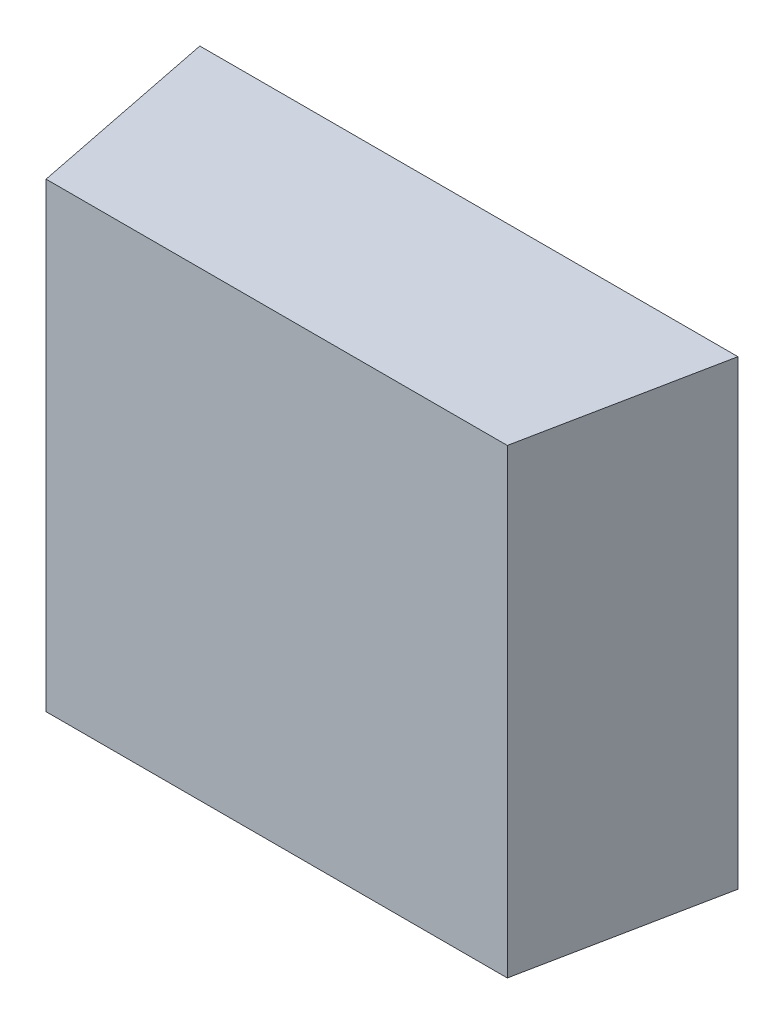
ISO-10303-21;
HEADER;
FILE_DESCRIPTION(('STEP AP214'),'2;1');
FILE_NAME('part.step','',(''),(''),'','','');
FILE_SCHEMA(('AUTOMOTIVE_DESIGN { 1 0 10303 214 1 1 1 1 }'));
ENDSEC;
DATA;
#1=APPLICATION_CONTEXT('core data for automotive mechanical design processes');
#2=APPLICATION_PROTOCOL_DEFINITION('international standard','automotive_design',2000,#1);
#3=PRODUCT_CONTEXT('',#1,'mechanical');
#4=PRODUCT('Part','Part','',(#3));
#5=PRODUCT_RELATED_PRODUCT_CATEGORY('part','',(#4));
#6=PRODUCT_DEFINITION_FORMATION('','',#4);
#7=PRODUCT_DEFINITION_CONTEXT('part definition',#1,'design');
#8=PRODUCT_DEFINITION('design','',#6,#7);
#9=PRODUCT_DEFINITION_SHAPE('','',#8);
#10=(LENGTH_UNIT() NAMED_UNIT(*) SI_UNIT(.MILLI.,.METRE.));
#11=(NAMED_UNIT(*) PLANE_ANGLE_UNIT() SI_UNIT($,.RADIAN.));
#12=(NAMED_UNIT(*) SI_UNIT($,.STERADIAN.) SOLID_ANGLE_UNIT());
#13=UNCERTAINTY_MEASURE_WITH_UNIT(LENGTH_MEASURE(1.E-05),#10,'distance_accuracy_value','');
#14=(GEOMETRIC_REPRESENTATION_CONTEXT(3) GLOBAL_UNCERTAINTY_ASSIGNED_CONTEXT((#13)) GLOBAL_UNIT_ASSIGNED_CONTEXT((#10,
#11,#12)) REPRESENTATION_CONTEXT('',''));
#15=CARTESIAN_POINT('',(0.,0.,0.));
#16=DIRECTION('',(0.,0.,1.));
#17=DIRECTION('',(1.,0.,0.));
#18=AXIS2_PLACEMENT_3D('',#15,#16,#17);
#19=CARTESIAN_POINT('',(-0.232885678621241,-0.927979057558617,0.0911708661417334));
#20=DIRECTION('',(0.,0.,-1.));
#21=DIRECTION('',(-1.,0.,0.));
#22=AXIS2_PLACEMENT_3D('',#19,#20,#21);
#23=PLANE('',#22);
#24=DIRECTION('',(0.,1.,0.));
#25=VECTOR('',#24,1.);
#26=CARTESIAN_POINT('',(-0.230925048699981,-0.927979057558617,0.0911708661417335));
#27=LINE('',#26,#25);
#28=CARTESIAN_POINT('',(-0.230925048699981,-0.929939687479877,0.0911708661417334));
#29=VERTEX_POINT('',#28);
#30=CARTESIAN_POINT('',(-0.230925048699981,-0.969152285905073,0.0911708661417334));
#31=VERTEX_POINT('',#30);
#32=EDGE_CURVE('E20',#29,#31,#27,.F.);
#33=ORIENTED_EDGE('',*,*,#32,.T.);
#34=DIRECTION('',(1.,0.,0.));
#35=VECTOR('',#34,1.);
#36=CARTESIAN_POINT('',(-0.236480166810218,-0.969152285905073,0.0911708661417334));
#37=LINE('',#36,#35);
#38=CARTESIAN_POINT('',(-0.191712450274785,-0.969152285905073,0.0911708661417334));
#39=VERTEX_POINT('',#38);
#40=EDGE_CURVE('E55',#39,#31,#37,.F.);
#41=ORIENTED_EDGE('',*,*,#40,.F.);
#42=DIRECTION('',(0.,1.,0.));
#43=VECTOR('',#42,1.);
#44=CARTESIAN_POINT('',(-0.191712450274784,-0.927979057558617,0.0911708661417335));
#45=LINE('',#44,#43);
#46=CARTESIAN_POINT('',(-0.191712450274785,-0.929939687479877,0.0911708661417335));
#47=VERTEX_POINT('',#46);
#48=EDGE_CURVE('E76',#39,#47,#45,.T.);
#49=ORIENTED_EDGE('',*,*,#48,.T.);
#50=DIRECTION('',(1.,0.,0.));
#51=VECTOR('',#50,1.);
#52=CARTESIAN_POINT('',(-0.236480166810218,-0.929939687479877,0.0911708661417334));
#53=LINE('',#52,#51);
#54=EDGE_CURVE('E58',#47,#29,#53,.F.);
#55=ORIENTED_EDGE('',*,*,#54,.T.);
#56=EDGE_LOOP('',(#33,#41,#49,#55));
#57=FACE_BOUND('',#56,.T.);
#58=ADVANCED_FACE('F17',(#57),#23,.F.);
#59=CARTESIAN_POINT('',(-0.234356151062186,-0.927979057558617,0.0740153543307098));
#60=DIRECTION('',(0.980580675690921,0.,-0.196116135138182));
#61=DIRECTION('',(-0.196116135138182,0.,-0.980580675690921));
#62=AXIS2_PLACEMENT_3D('',#59,#60,#61);
#63=PLANE('',#62);
#64=DIRECTION('',(0.,1.,0.));
#65=VECTOR('',#64,1.);
#66=CARTESIAN_POINT('',(-0.234192765235415,-0.927979057558617,0.0748322834645681));
#67=LINE('',#66,#65);
#68=CARTESIAN_POINT('',(-0.234192765235415,-0.929939687479877,0.0748322834645681));
#69=VERTEX_POINT('',#68);
#70=CARTESIAN_POINT('',(-0.234192765235415,-0.969152285905073,0.0748322834645681));
#71=VERTEX_POINT('',#70);
#72=EDGE_CURVE('E73',#69,#71,#67,.F.);
#73=ORIENTED_EDGE('',*,*,#72,.T.);
#74=DIRECTION('',(-0.196116135138237,0.,-0.98058067569091));
#75=VECTOR('',#74,1.);
#76=CARTESIAN_POINT('',(-0.230925048699981,-0.969152285905073,0.0911708661417334));
#77=LINE('',#76,#75);
#78=EDGE_CURVE('E63',#31,#71,#77,.T.);
#79=ORIENTED_EDGE('',*,*,#78,.F.);
#80=ORIENTED_EDGE('',*,*,#32,.F.);
#81=DIRECTION('',(-0.196116135138237,0.,-0.98058067569091));
#82=VECTOR('',#81,1.);
#83=CARTESIAN_POINT('',(-0.230925048699981,-0.929939687479877,0.0911708661417334));
#84=LINE('',#83,#82);
#85=EDGE_CURVE('E80',#29,#69,#84,.T.);
#86=ORIENTED_EDGE('',*,*,#85,.T.);
#87=EDGE_LOOP('',(#73,#79,#80,#86));
#88=FACE_BOUND('',#87,.T.);
#89=ADVANCED_FACE('F72',(#88),#63,.F.);
#90=CARTESIAN_POINT('',(-0.236480166810218,-0.969152285905073,0.0740153543307098));
#91=DIRECTION('',(0.,-1.,0.));
#92=DIRECTION('',(1.,0.,0.));
#93=AXIS2_PLACEMENT_3D('',#90,#91,#92);
#94=PLANE('',#93);
#95=DIRECTION('',(-0.196116135138182,0.,0.980580675690921));
#96=VECTOR('',#95,1.);
#97=CARTESIAN_POINT('',(-0.191875836101556,-0.969152285905073,0.0919877952755917));
#98=LINE('',#97,#96);
#99=CARTESIAN_POINT('',(-0.188444733739352,-0.969152285905073,0.0748322834645681));
#100=VERTEX_POINT('',#99);
#101=EDGE_CURVE('E69',#100,#39,#98,.T.);
#102=ORIENTED_EDGE('',*,*,#101,.T.);
#103=ORIENTED_EDGE('',*,*,#40,.T.);
#104=ORIENTED_EDGE('',*,*,#78,.T.);
#105=DIRECTION('',(1.,0.,0.));
#106=VECTOR('',#105,1.);
#107=CARTESIAN_POINT('',(-0.186157332164548,-0.969152285905073,0.0748322834645681));
#108=LINE('',#107,#106);
#109=EDGE_CURVE('E83',#71,#100,#108,.T.);
#110=ORIENTED_EDGE('',*,*,#109,.T.);
#111=EDGE_LOOP('',(#102,#103,#104,#110));
#112=FACE_BOUND('',#111,.T.);
#113=ADVANCED_FACE('F66',(#112),#94,.T.);
#114=CARTESIAN_POINT('',(-0.191875836101556,-0.927979057558617,0.0919877952755917));
#115=DIRECTION('',(-0.980580675690921,0.,-0.196116135138182));
#116=DIRECTION('',(-0.196116135138182,0.,0.980580675690921));
#117=AXIS2_PLACEMENT_3D('',#114,#115,#116);
#118=PLANE('',#117);
#119=ORIENTED_EDGE('',*,*,#48,.F.);
#120=ORIENTED_EDGE('',*,*,#101,.F.);
#121=DIRECTION('',(0.,1.,0.));
#122=VECTOR('',#121,1.);
#123=CARTESIAN_POINT('',(-0.188444733739352,-0.927979057558617,0.0748322834645681));
#124=LINE('',#123,#122);
#125=CARTESIAN_POINT('',(-0.188444733739352,-0.929939687479877,0.0748322834645682));
#126=VERTEX_POINT('',#125);
#127=EDGE_CURVE('E26',#100,#126,#124,.T.);
#128=ORIENTED_EDGE('',*,*,#127,.T.);
#129=DIRECTION('',(-0.196116135138181,0.,0.980580675690921));
#130=VECTOR('',#129,1.);
#131=CARTESIAN_POINT('',(-0.188444733739352,-0.929939687479877,0.0748322834645681));
#132=LINE('',#131,#130);
#133=EDGE_CURVE('E34',#126,#47,#132,.T.);
#134=ORIENTED_EDGE('',*,*,#133,.T.);
#135=EDGE_LOOP('',(#119,#120,#128,#134));
#136=FACE_BOUND('',#135,.T.);
#137=ADVANCED_FACE('F88',(#136),#118,.F.);
#138=CARTESIAN_POINT('',(-0.236480166810218,-0.929939687479877,0.0740153543307098));
#139=DIRECTION('',(0.,-1.,0.));
#140=DIRECTION('',(1.,0.,0.));
#141=AXIS2_PLACEMENT_3D('',#138,#139,#140);
#142=PLANE('',#141);
#143=ORIENTED_EDGE('',*,*,#54,.F.);
#144=ORIENTED_EDGE('',*,*,#133,.F.);
#145=DIRECTION('',(1.,0.,0.));
#146=VECTOR('',#145,1.);
#147=CARTESIAN_POINT('',(-0.186157332164548,-0.929939687479877,0.0748322834645681));
#148=LINE('',#147,#146);
#149=EDGE_CURVE('E11',#126,#69,#148,.F.);
#150=ORIENTED_EDGE('',*,*,#149,.T.);
#151=ORIENTED_EDGE('',*,*,#85,.F.);
#152=EDGE_LOOP('',(#143,#144,#150,#151));
#153=FACE_BOUND('',#152,.T.);
#154=ADVANCED_FACE('F91',(#153),#142,.F.);
#155=CARTESIAN_POINT('',(-0.186157332164548,-0.927979057558617,0.0748322834645681));
#156=DIRECTION('',(0.,0.,1.));
#157=DIRECTION('',(1.,0.,0.));
#158=AXIS2_PLACEMENT_3D('',#155,#156,#157);
#159=PLANE('',#158);
#160=ORIENTED_EDGE('',*,*,#127,.F.);
#161=ORIENTED_EDGE('',*,*,#109,.F.);
#162=ORIENTED_EDGE('',*,*,#72,.F.);
#163=ORIENTED_EDGE('',*,*,#149,.F.);
#164=EDGE_LOOP('',(#160,#161,#162,#163));
#165=FACE_BOUND('',#164,.T.);
#166=ADVANCED_FACE('F90',(#165),#159,.F.);
#167=CLOSED_SHELL('',(#58,#89,#113,#137,#154,#166));
#168=MANIFOLD_SOLID_BREP('B1',#167);
#169=ADVANCED_BREP_SHAPE_REPRESENTATION('',(#18,#168),#14);
#170=SHAPE_DEFINITION_REPRESENTATION(#9,#169);
ENDSEC;
END-ISO-10303-21;
